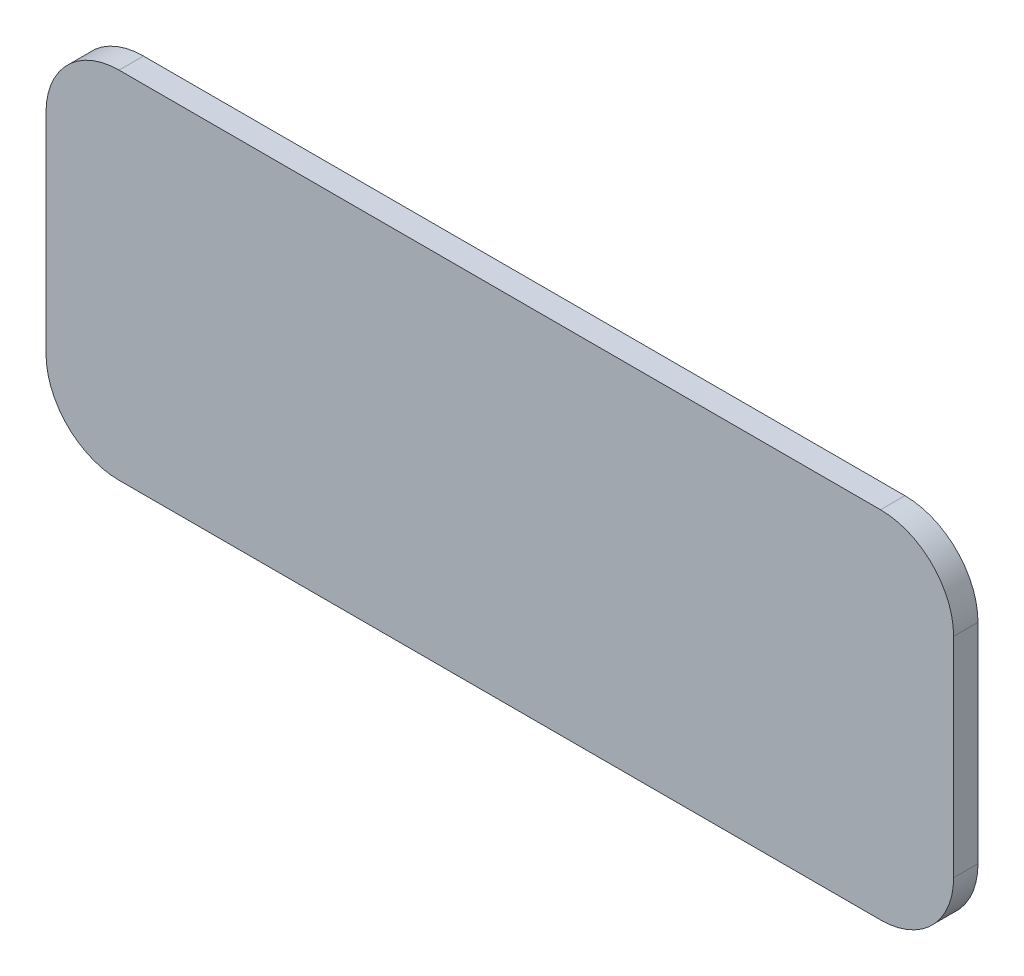
ISO-10303-21;
HEADER;
FILE_DESCRIPTION(('STEP AP214'),'2;1');
FILE_NAME('part.step','',(''),(''),'','','');
FILE_SCHEMA(('AUTOMOTIVE_DESIGN { 1 0 10303 214 1 1 1 1 }'));
ENDSEC;
DATA;
#1=APPLICATION_CONTEXT('core data for automotive mechanical design processes');
#2=APPLICATION_PROTOCOL_DEFINITION('international standard','automotive_design',2000,#1);
#3=PRODUCT_CONTEXT('',#1,'mechanical');
#4=PRODUCT('Part','Part','',(#3));
#5=PRODUCT_RELATED_PRODUCT_CATEGORY('part','',(#4));
#6=PRODUCT_DEFINITION_FORMATION('','',#4);
#7=PRODUCT_DEFINITION_CONTEXT('part definition',#1,'design');
#8=PRODUCT_DEFINITION('design','',#6,#7);
#9=PRODUCT_DEFINITION_SHAPE('','',#8);
#10=(LENGTH_UNIT() NAMED_UNIT(*) SI_UNIT(.MILLI.,.METRE.));
#11=(NAMED_UNIT(*) PLANE_ANGLE_UNIT() SI_UNIT($,.RADIAN.));
#12=(NAMED_UNIT(*) SI_UNIT($,.STERADIAN.) SOLID_ANGLE_UNIT());
#13=UNCERTAINTY_MEASURE_WITH_UNIT(LENGTH_MEASURE(1.E-05),#10,'distance_accuracy_value','');
#14=(GEOMETRIC_REPRESENTATION_CONTEXT(3) GLOBAL_UNCERTAINTY_ASSIGNED_CONTEXT((#13)) GLOBAL_UNIT_ASSIGNED_CONTEXT((#10,
#11,#12)) REPRESENTATION_CONTEXT('',''));
#15=CARTESIAN_POINT('',(0.,0.,0.));
#16=DIRECTION('',(0.,0.,1.));
#17=DIRECTION('',(1.,0.,0.));
#18=AXIS2_PLACEMENT_3D('',#15,#16,#17);
#19=CARTESIAN_POINT('',(-250.5,-17.5,6.));
#20=DIRECTION('',(0.,0.,-1.));
#21=DIRECTION('',(-1.,0.,0.));
#22=AXIS2_PLACEMENT_3D('',#19,#20,#21);
#23=CYLINDRICAL_SURFACE('',#22,18.);
#24=CARTESIAN_POINT('',(-250.5,-17.5,0.));
#25=DIRECTION('',(0.,0.,1.));
#26=DIRECTION('',(-1.,0.,0.));
#27=AXIS2_PLACEMENT_3D('',#24,#25,#26);
#28=CIRCLE('',#27,18.);
#29=CARTESIAN_POINT('',(-268.5,-17.5,0.));
#30=VERTEX_POINT('',#29);
#31=CARTESIAN_POINT('',(-250.5,-35.5,0.));
#32=VERTEX_POINT('',#31);
#33=EDGE_CURVE('E140',#30,#32,#28,.T.);
#34=ORIENTED_EDGE('',*,*,#33,.T.);
#35=DIRECTION('',(0.,0.,-1.));
#36=VECTOR('',#35,1.);
#37=CARTESIAN_POINT('',(-250.5,-35.5,6.));
#38=LINE('',#37,#36);
#39=CARTESIAN_POINT('',(-250.5,-35.5,6.));
#40=VERTEX_POINT('',#39);
#41=EDGE_CURVE('E11',#40,#32,#38,.T.);
#42=ORIENTED_EDGE('',*,*,#41,.F.);
#43=CARTESIAN_POINT('',(-250.5,-17.5,6.));
#44=DIRECTION('',(0.,0.,1.));
#45=DIRECTION('',(-1.,0.,0.));
#46=AXIS2_PLACEMENT_3D('',#43,#44,#45);
#47=CIRCLE('',#46,18.);
#48=CARTESIAN_POINT('',(-268.5,-17.5,6.));
#49=VERTEX_POINT('',#48);
#50=EDGE_CURVE('E157',#49,#40,#47,.T.);
#51=ORIENTED_EDGE('',*,*,#50,.F.);
#52=DIRECTION('',(0.,0.,-1.));
#53=VECTOR('',#52,1.);
#54=CARTESIAN_POINT('',(-268.5,-17.5,6.));
#55=LINE('',#54,#53);
#56=EDGE_CURVE('E136',#49,#30,#55,.T.);
#57=ORIENTED_EDGE('',*,*,#56,.T.);
#58=EDGE_LOOP('',(#34,#42,#51,#57));
#59=FACE_BOUND('',#58,.T.);
#60=ADVANCED_FACE('F41',(#59),#23,.T.);
#61=CARTESIAN_POINT('',(-62.9918118667271,-35.5,6.));
#62=DIRECTION('',(0.,1.,0.));
#63=DIRECTION('',(-1.,0.,0.));
#64=AXIS2_PLACEMENT_3D('',#61,#62,#63);
#65=PLANE('',#64);
#66=DIRECTION('',(1.,0.,0.));
#67=VECTOR('',#66,1.);
#68=CARTESIAN_POINT('',(-62.9918118667271,-35.5,0.));
#69=LINE('',#68,#67);
#70=CARTESIAN_POINT('',(-62.9918118667271,-35.5,0.));
#71=VERTEX_POINT('',#70);
#72=EDGE_CURVE('E143',#32,#71,#69,.T.);
#73=ORIENTED_EDGE('',*,*,#72,.T.);
#74=DIRECTION('',(0.,0.,-1.));
#75=VECTOR('',#74,1.);
#76=CARTESIAN_POINT('',(-62.9918118667271,-35.5,6.));
#77=LINE('',#76,#75);
#78=CARTESIAN_POINT('',(-62.9918118667271,-35.5,6.));
#79=VERTEX_POINT('',#78);
#80=EDGE_CURVE('E49',#79,#71,#77,.T.);
#81=ORIENTED_EDGE('',*,*,#80,.F.);
#82=DIRECTION('',(1.,0.,0.));
#83=VECTOR('',#82,1.);
#84=CARTESIAN_POINT('',(-62.9918118667271,-35.5,6.));
#85=LINE('',#84,#83);
#86=EDGE_CURVE('E101',#40,#79,#85,.T.);
#87=ORIENTED_EDGE('',*,*,#86,.F.);
#88=ORIENTED_EDGE('',*,*,#41,.T.);
#89=EDGE_LOOP('',(#73,#81,#87,#88));
#90=FACE_BOUND('',#89,.T.);
#91=ADVANCED_FACE('F195',(#90),#65,.F.);
#92=CARTESIAN_POINT('',(-62.9918118667271,-17.5,6.));
#93=DIRECTION('',(0.,0.,-1.));
#94=DIRECTION('',(-1.,0.,0.));
#95=AXIS2_PLACEMENT_3D('',#92,#93,#94);
#96=CYLINDRICAL_SURFACE('',#95,18.);
#97=CARTESIAN_POINT('',(-62.9918118667271,-17.5,0.));
#98=DIRECTION('',(0.,0.,1.));
#99=DIRECTION('',(-1.,0.,0.));
#100=AXIS2_PLACEMENT_3D('',#97,#98,#99);
#101=CIRCLE('',#100,18.);
#102=CARTESIAN_POINT('',(-44.9918118667271,-17.5,0.));
#103=VERTEX_POINT('',#102);
#104=EDGE_CURVE('E146',#71,#103,#101,.T.);
#105=ORIENTED_EDGE('',*,*,#104,.T.);
#106=DIRECTION('',(0.,0.,-1.));
#107=VECTOR('',#106,1.);
#108=CARTESIAN_POINT('',(-44.9918118667271,-17.5,6.));
#109=LINE('',#108,#107);
#110=CARTESIAN_POINT('',(-44.9918118667271,-17.5,6.));
#111=VERTEX_POINT('',#110);
#112=EDGE_CURVE('E164',#111,#103,#109,.T.);
#113=ORIENTED_EDGE('',*,*,#112,.F.);
#114=CARTESIAN_POINT('',(-62.9918118667271,-17.5,6.));
#115=DIRECTION('',(0.,0.,1.));
#116=DIRECTION('',(-1.,0.,0.));
#117=AXIS2_PLACEMENT_3D('',#114,#115,#116);
#118=CIRCLE('',#117,18.);
#119=EDGE_CURVE('E174',#79,#111,#118,.T.);
#120=ORIENTED_EDGE('',*,*,#119,.F.);
#121=ORIENTED_EDGE('',*,*,#80,.T.);
#122=EDGE_LOOP('',(#105,#113,#120,#121));
#123=FACE_BOUND('',#122,.T.);
#124=ADVANCED_FACE('F172',(#123),#96,.T.);
#125=CARTESIAN_POINT('',(-44.9918118667271,33.9824750795386,6.));
#126=DIRECTION('',(-1.,0.,0.));
#127=DIRECTION('',(0.,-1.,0.));
#128=AXIS2_PLACEMENT_3D('',#125,#126,#127);
#129=PLANE('',#128);
#130=DIRECTION('',(0.,1.,0.));
#131=VECTOR('',#130,1.);
#132=CARTESIAN_POINT('',(-44.9918118667271,33.9824750795386,0.));
#133=LINE('',#132,#131);
#134=CARTESIAN_POINT('',(-44.9918118667271,33.9824750795386,0.));
#135=VERTEX_POINT('',#134);
#136=EDGE_CURVE('E149',#103,#135,#133,.T.);
#137=ORIENTED_EDGE('',*,*,#136,.T.);
#138=DIRECTION('',(0.,0.,-1.));
#139=VECTOR('',#138,1.);
#140=CARTESIAN_POINT('',(-44.9918118667271,33.9824750795386,6.));
#141=LINE('',#140,#139);
#142=CARTESIAN_POINT('',(-44.9918118667271,33.9824750795386,6.));
#143=VERTEX_POINT('',#142);
#144=EDGE_CURVE('E161',#143,#135,#141,.T.);
#145=ORIENTED_EDGE('',*,*,#144,.F.);
#146=DIRECTION('',(0.,1.,0.));
#147=VECTOR('',#146,1.);
#148=CARTESIAN_POINT('',(-44.9918118667271,33.9824750795386,6.));
#149=LINE('',#148,#147);
#150=EDGE_CURVE('E186',#111,#143,#149,.T.);
#151=ORIENTED_EDGE('',*,*,#150,.F.);
#152=ORIENTED_EDGE('',*,*,#112,.T.);
#153=EDGE_LOOP('',(#137,#145,#151,#152));
#154=FACE_BOUND('',#153,.T.);
#155=ADVANCED_FACE('F182',(#154),#129,.F.);
#156=CARTESIAN_POINT('',(-62.9918118667272,33.9824750795385,6.));
#157=DIRECTION('',(0.,0.,-1.));
#158=DIRECTION('',(-1.,0.,0.));
#159=AXIS2_PLACEMENT_3D('',#156,#157,#158);
#160=CYLINDRICAL_SURFACE('',#159,18.0000000000001);
#161=CARTESIAN_POINT('',(-62.9918118667272,33.9824750795385,0.));
#162=DIRECTION('',(0.,0.,1.));
#163=DIRECTION('',(-1.,0.,0.));
#164=AXIS2_PLACEMENT_3D('',#161,#162,#163);
#165=CIRCLE('',#164,18.0000000000001);
#166=CARTESIAN_POINT('',(-62.9918118667272,51.9824750795386,0.));
#167=VERTEX_POINT('',#166);
#168=EDGE_CURVE('E151',#135,#167,#165,.T.);
#169=ORIENTED_EDGE('',*,*,#168,.T.);
#170=DIRECTION('',(0.,0.,-1.));
#171=VECTOR('',#170,1.);
#172=CARTESIAN_POINT('',(-62.9918118667272,51.9824750795386,6.));
#173=LINE('',#172,#171);
#174=CARTESIAN_POINT('',(-62.9918118667272,51.9824750795386,6.));
#175=VERTEX_POINT('',#174);
#176=EDGE_CURVE('E131',#175,#167,#173,.T.);
#177=ORIENTED_EDGE('',*,*,#176,.F.);
#178=CARTESIAN_POINT('',(-62.9918118667272,33.9824750795385,6.));
#179=DIRECTION('',(0.,0.,1.));
#180=DIRECTION('',(-1.,0.,0.));
#181=AXIS2_PLACEMENT_3D('',#178,#179,#180);
#182=CIRCLE('',#181,18.0000000000001);
#183=EDGE_CURVE('E121',#143,#175,#182,.T.);
#184=ORIENTED_EDGE('',*,*,#183,.F.);
#185=ORIENTED_EDGE('',*,*,#144,.T.);
#186=EDGE_LOOP('',(#169,#177,#184,#185));
#187=FACE_BOUND('',#186,.T.);
#188=ADVANCED_FACE('F185',(#187),#160,.T.);
#189=CARTESIAN_POINT('',(-250.5,51.9824750795386,6.));
#190=DIRECTION('',(0.,-1.,0.));
#191=DIRECTION('',(1.,0.,0.));
#192=AXIS2_PLACEMENT_3D('',#189,#190,#191);
#193=PLANE('',#192);
#194=DIRECTION('',(-1.,0.,0.));
#195=VECTOR('',#194,1.);
#196=CARTESIAN_POINT('',(-250.5,51.9824750795386,0.));
#197=LINE('',#196,#195);
#198=CARTESIAN_POINT('',(-250.5,51.9824750795386,0.));
#199=VERTEX_POINT('',#198);
#200=EDGE_CURVE('E130',#167,#199,#197,.T.);
#201=ORIENTED_EDGE('',*,*,#200,.T.);
#202=DIRECTION('',(0.,0.,-1.));
#203=VECTOR('',#202,1.);
#204=CARTESIAN_POINT('',(-250.5,51.9824750795386,6.));
#205=LINE('',#204,#203);
#206=CARTESIAN_POINT('',(-250.5,51.9824750795386,6.));
#207=VERTEX_POINT('',#206);
#208=EDGE_CURVE('E127',#207,#199,#205,.T.);
#209=ORIENTED_EDGE('',*,*,#208,.F.);
#210=DIRECTION('',(-1.,0.,0.));
#211=VECTOR('',#210,1.);
#212=CARTESIAN_POINT('',(-250.5,51.9824750795386,6.));
#213=LINE('',#212,#211);
#214=EDGE_CURVE('E115',#175,#207,#213,.T.);
#215=ORIENTED_EDGE('',*,*,#214,.F.);
#216=ORIENTED_EDGE('',*,*,#176,.T.);
#217=EDGE_LOOP('',(#201,#209,#215,#216));
#218=FACE_BOUND('',#217,.T.);
#219=ADVANCED_FACE('F128',(#218),#193,.F.);
#220=CARTESIAN_POINT('',(-250.5,33.9824750795385,6.));
#221=DIRECTION('',(0.,0.,-1.));
#222=DIRECTION('',(-1.,0.,0.));
#223=AXIS2_PLACEMENT_3D('',#220,#221,#222);
#224=CYLINDRICAL_SURFACE('',#223,18.);
#225=CARTESIAN_POINT('',(-250.5,33.9824750795385,0.));
#226=DIRECTION('',(0.,0.,1.));
#227=DIRECTION('',(-1.,0.,0.));
#228=AXIS2_PLACEMENT_3D('',#225,#226,#227);
#229=CIRCLE('',#228,18.);
#230=CARTESIAN_POINT('',(-268.5,33.9824750795386,0.));
#231=VERTEX_POINT('',#230);
#232=EDGE_CURVE('E87',#199,#231,#229,.T.);
#233=ORIENTED_EDGE('',*,*,#232,.T.);
#234=DIRECTION('',(0.,0.,-1.));
#235=VECTOR('',#234,1.);
#236=CARTESIAN_POINT('',(-268.5,33.9824750795386,6.));
#237=LINE('',#236,#235);
#238=CARTESIAN_POINT('',(-268.5,33.9824750795386,6.));
#239=VERTEX_POINT('',#238);
#240=EDGE_CURVE('E132',#239,#231,#237,.T.);
#241=ORIENTED_EDGE('',*,*,#240,.F.);
#242=CARTESIAN_POINT('',(-250.5,33.9824750795385,6.));
#243=DIRECTION('',(0.,0.,1.));
#244=DIRECTION('',(-1.,0.,0.));
#245=AXIS2_PLACEMENT_3D('',#242,#243,#244);
#246=CIRCLE('',#245,18.);
#247=EDGE_CURVE('E119',#207,#239,#246,.T.);
#248=ORIENTED_EDGE('',*,*,#247,.F.);
#249=ORIENTED_EDGE('',*,*,#208,.T.);
#250=EDGE_LOOP('',(#233,#241,#248,#249));
#251=FACE_BOUND('',#250,.T.);
#252=ADVANCED_FACE('F134',(#251),#224,.T.);
#253=CARTESIAN_POINT('',(-268.5,-17.5,6.));
#254=DIRECTION('',(1.,0.,0.));
#255=DIRECTION('',(0.,0.,-1.));
#256=AXIS2_PLACEMENT_3D('',#253,#254,#255);
#257=PLANE('',#256);
#258=DIRECTION('',(0.,-1.,0.));
#259=VECTOR('',#258,1.);
#260=CARTESIAN_POINT('',(-268.5,-17.5,0.));
#261=LINE('',#260,#259);
#262=EDGE_CURVE('E93',#231,#30,#261,.T.);
#263=ORIENTED_EDGE('',*,*,#262,.T.);
#264=ORIENTED_EDGE('',*,*,#56,.F.);
#265=DIRECTION('',(0.,-1.,0.));
#266=VECTOR('',#265,1.);
#267=CARTESIAN_POINT('',(-268.5,-17.5,6.));
#268=LINE('',#267,#266);
#269=EDGE_CURVE('E57',#239,#49,#268,.T.);
#270=ORIENTED_EDGE('',*,*,#269,.F.);
#271=ORIENTED_EDGE('',*,*,#240,.T.);
#272=EDGE_LOOP('',(#263,#264,#270,#271));
#273=FACE_BOUND('',#272,.T.);
#274=ADVANCED_FACE('F211',(#273),#257,.F.);
#275=CARTESIAN_POINT('',(-250.5,-17.5,6.));
#276=DIRECTION('',(0.,0.,-1.));
#277=DIRECTION('',(-1.,0.,0.));
#278=AXIS2_PLACEMENT_3D('',#275,#276,#277);
#279=PLANE('',#278);
#280=ORIENTED_EDGE('',*,*,#50,.T.);
#281=ORIENTED_EDGE('',*,*,#86,.T.);
#282=ORIENTED_EDGE('',*,*,#119,.T.);
#283=ORIENTED_EDGE('',*,*,#150,.T.);
#284=ORIENTED_EDGE('',*,*,#183,.T.);
#285=ORIENTED_EDGE('',*,*,#214,.T.);
#286=ORIENTED_EDGE('',*,*,#247,.T.);
#287=ORIENTED_EDGE('',*,*,#269,.T.);
#288=EDGE_LOOP('',(#280,#281,#282,#283,#284,#285,#286,#287));
#289=FACE_BOUND('',#288,.T.);
#290=ADVANCED_FACE('F117',(#289),#279,.F.);
#291=CARTESIAN_POINT('',(-250.5,-17.5,0.));
#292=DIRECTION('',(0.,0.,-1.));
#293=DIRECTION('',(-1.,0.,0.));
#294=AXIS2_PLACEMENT_3D('',#291,#292,#293);
#295=PLANE('',#294);
#296=ORIENTED_EDGE('',*,*,#33,.F.);
#297=ORIENTED_EDGE('',*,*,#262,.F.);
#298=ORIENTED_EDGE('',*,*,#232,.F.);
#299=ORIENTED_EDGE('',*,*,#200,.F.);
#300=ORIENTED_EDGE('',*,*,#168,.F.);
#301=ORIENTED_EDGE('',*,*,#136,.F.);
#302=ORIENTED_EDGE('',*,*,#104,.F.);
#303=ORIENTED_EDGE('',*,*,#72,.F.);
#304=EDGE_LOOP('',(#296,#297,#298,#299,#300,#301,#302,#303));
#305=FACE_BOUND('',#304,.T.);
#306=ADVANCED_FACE('F178',(#305),#295,.T.);
#307=CLOSED_SHELL('',(#60,#91,#124,#155,#188,#219,#252,#274,#290,#306));
#308=MANIFOLD_SOLID_BREP('B2',#307);
#309=ADVANCED_BREP_SHAPE_REPRESENTATION('',(#18,#308),#14);
#310=SHAPE_DEFINITION_REPRESENTATION(#9,#309);
ENDSEC;
END-ISO-10303-21;
